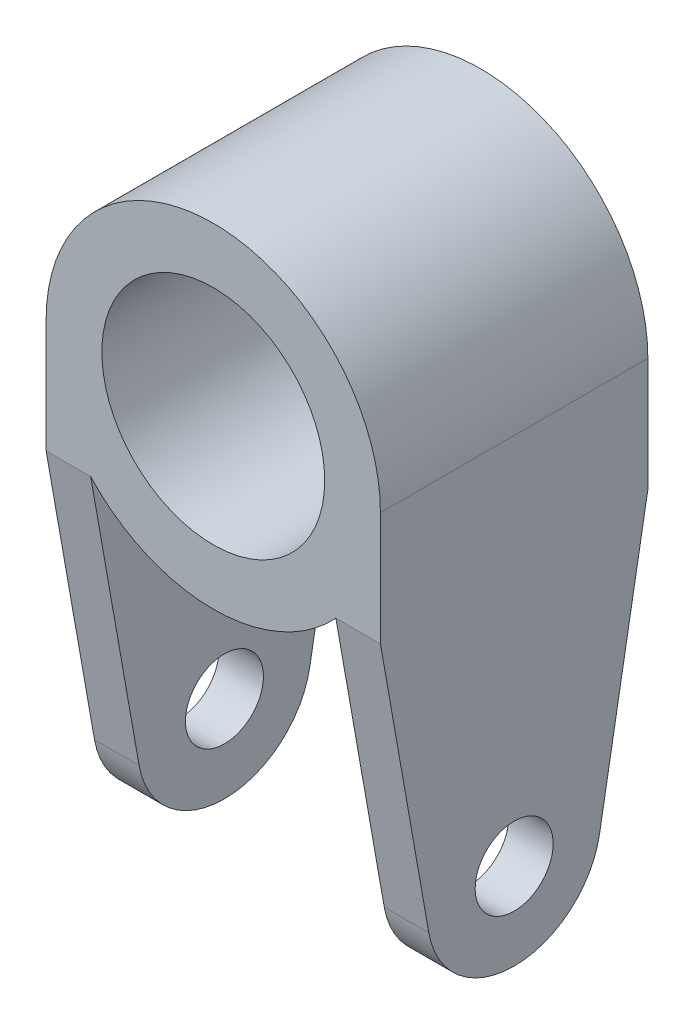
ISO-10303-21;
HEADER;
FILE_DESCRIPTION(('STEP AP214'),'2;1');
FILE_NAME('part.step','',(''),(''),'','','');
FILE_SCHEMA(('AUTOMOTIVE_DESIGN { 1 0 10303 214 1 1 1 1 }'));
ENDSEC;
DATA;
#1=APPLICATION_CONTEXT('core data for automotive mechanical design processes');
#2=APPLICATION_PROTOCOL_DEFINITION('international standard','automotive_design',2000,#1);
#3=PRODUCT_CONTEXT('',#1,'mechanical');
#4=PRODUCT('Part','Part','',(#3));
#5=PRODUCT_RELATED_PRODUCT_CATEGORY('part','',(#4));
#6=PRODUCT_DEFINITION_FORMATION('','',#4);
#7=PRODUCT_DEFINITION_CONTEXT('part definition',#1,'design');
#8=PRODUCT_DEFINITION('design','',#6,#7);
#9=PRODUCT_DEFINITION_SHAPE('','',#8);
#10=(LENGTH_UNIT() NAMED_UNIT(*) SI_UNIT(.MILLI.,.METRE.));
#11=(NAMED_UNIT(*) PLANE_ANGLE_UNIT() SI_UNIT($,.RADIAN.));
#12=(NAMED_UNIT(*) SI_UNIT($,.STERADIAN.) SOLID_ANGLE_UNIT());
#13=UNCERTAINTY_MEASURE_WITH_UNIT(LENGTH_MEASURE(1.E-05),#10,'distance_accuracy_value','');
#14=(GEOMETRIC_REPRESENTATION_CONTEXT(3) GLOBAL_UNCERTAINTY_ASSIGNED_CONTEXT((#13)) GLOBAL_UNIT_ASSIGNED_CONTEXT((#10,
#11,#12)) REPRESENTATION_CONTEXT('',''));
#15=CARTESIAN_POINT('',(0.,0.,0.));
#16=DIRECTION('',(0.,0.,1.));
#17=DIRECTION('',(1.,0.,0.));
#18=AXIS2_PLACEMENT_3D('',#15,#16,#17);
#19=CARTESIAN_POINT('',(0.,0.,24.));
#20=DIRECTION('',(0.,0.,1.));
#21=DIRECTION('',(1.,0.,0.));
#22=AXIS2_PLACEMENT_3D('',#19,#20,#21);
#23=PLANE('',#22);
#24=DIRECTION('',(1.,0.,0.));
#25=VECTOR('',#24,1.);
#26=CARTESIAN_POINT('',(-15.001,-10.1980390271856,24.));
#27=LINE('',#26,#25);
#28=CARTESIAN_POINT('',(11.,-10.1980390271856,24.));
#29=VERTEX_POINT('',#28);
#30=CARTESIAN_POINT('',(15.,-10.1980390271856,24.));
#31=VERTEX_POINT('',#30);
#32=EDGE_CURVE('E113',#29,#31,#27,.T.);
#33=ORIENTED_EDGE('',*,*,#32,.T.);
#34=DIRECTION('',(0.,1.,0.));
#35=VECTOR('',#34,1.);
#36=CARTESIAN_POINT('',(15.,-22.,24.));
#37=LINE('',#36,#35);
#38=CARTESIAN_POINT('',(15.,0.,24.));
#39=VERTEX_POINT('',#38);
#40=EDGE_CURVE('E145',#31,#39,#37,.T.);
#41=ORIENTED_EDGE('',*,*,#40,.T.);
#42=CARTESIAN_POINT('',(0.,0.,24.));
#43=DIRECTION('',(0.,0.,1.));
#44=DIRECTION('',(1.,0.,0.));
#45=AXIS2_PLACEMENT_3D('',#42,#43,#44);
#46=CIRCLE('',#45,15.);
#47=CARTESIAN_POINT('',(-15.,0.,24.));
#48=VERTEX_POINT('',#47);
#49=EDGE_CURVE('E159',#39,#48,#46,.T.);
#50=ORIENTED_EDGE('',*,*,#49,.T.);
#51=DIRECTION('',(0.,-1.,0.));
#52=VECTOR('',#51,1.);
#53=CARTESIAN_POINT('',(-15.,0.,24.));
#54=LINE('',#53,#52);
#55=CARTESIAN_POINT('',(-15.,-10.1980390271856,24.));
#56=VERTEX_POINT('',#55);
#57=EDGE_CURVE('E146',#48,#56,#54,.T.);
#58=ORIENTED_EDGE('',*,*,#57,.T.);
#59=DIRECTION('',(-1.,0.,0.));
#60=VECTOR('',#59,1.);
#61=CARTESIAN_POINT('',(15.001,-10.1980390271856,24.));
#62=LINE('',#61,#60);
#63=CARTESIAN_POINT('',(-11.,-10.1980390271856,24.));
#64=VERTEX_POINT('',#63);
#65=EDGE_CURVE('E141',#64,#56,#62,.T.);
#66=ORIENTED_EDGE('',*,*,#65,.F.);
#67=CARTESIAN_POINT('',(0.,0.,24.));
#68=DIRECTION('',(0.,0.,1.));
#69=DIRECTION('',(1.,0.,0.));
#70=AXIS2_PLACEMENT_3D('',#67,#68,#69);
#71=CIRCLE('',#70,15.);
#72=EDGE_CURVE('E138',#64,#29,#71,.T.);
#73=ORIENTED_EDGE('',*,*,#72,.T.);
#74=EDGE_LOOP('',(#33,#41,#50,#58,#66,#73));
#75=FACE_BOUND('',#74,.T.);
#76=CARTESIAN_POINT('',(0.,0.,24.));
#77=DIRECTION('',(0.,0.,1.));
#78=DIRECTION('',(1.,0.,0.));
#79=AXIS2_PLACEMENT_3D('',#76,#77,#78);
#80=CIRCLE('',#79,10.);
#81=CARTESIAN_POINT('',(10.,0.,24.));
#82=VERTEX_POINT('',#81);
#83=EDGE_CURVE('E167',#82,#82,#80,.T.);
#84=ORIENTED_EDGE('',*,*,#83,.F.);
#85=EDGE_LOOP('',(#84));
#86=FACE_BOUND('',#85,.T.);
#87=ADVANCED_FACE('F36',(#75,#86),#23,.T.);
#88=CARTESIAN_POINT('',(0.,0.,0.));
#89=DIRECTION('',(0.,0.,1.));
#90=DIRECTION('',(1.,0.,0.));
#91=AXIS2_PLACEMENT_3D('',#88,#89,#90);
#92=PLANE('',#91);
#93=DIRECTION('',(0.,1.,0.));
#94=VECTOR('',#93,1.);
#95=CARTESIAN_POINT('',(15.,0.,0.));
#96=LINE('',#95,#94);
#97=CARTESIAN_POINT('',(15.,-10.1980390271856,0.));
#98=VERTEX_POINT('',#97);
#99=CARTESIAN_POINT('',(15.,0.,0.));
#100=VERTEX_POINT('',#99);
#101=EDGE_CURVE('E157',#98,#100,#96,.T.);
#102=ORIENTED_EDGE('',*,*,#101,.F.);
#103=DIRECTION('',(1.,0.,0.));
#104=VECTOR('',#103,1.);
#105=CARTESIAN_POINT('',(-15.001,-10.1980390271856,0.));
#106=LINE('',#105,#104);
#107=CARTESIAN_POINT('',(11.,-10.1980390271856,0.));
#108=VERTEX_POINT('',#107);
#109=EDGE_CURVE('E123',#108,#98,#106,.T.);
#110=ORIENTED_EDGE('',*,*,#109,.F.);
#111=CARTESIAN_POINT('',(0.,0.,0.));
#112=DIRECTION('',(0.,0.,1.));
#113=DIRECTION('',(1.,0.,0.));
#114=AXIS2_PLACEMENT_3D('',#111,#112,#113);
#115=CIRCLE('',#114,15.);
#116=CARTESIAN_POINT('',(-11.,-10.1980390271856,0.));
#117=VERTEX_POINT('',#116);
#118=EDGE_CURVE('E151',#117,#108,#115,.T.);
#119=ORIENTED_EDGE('',*,*,#118,.F.);
#120=DIRECTION('',(-1.,0.,0.));
#121=VECTOR('',#120,1.);
#122=CARTESIAN_POINT('',(15.001,-10.1980390271856,0.));
#123=LINE('',#122,#121);
#124=CARTESIAN_POINT('',(-15.,-10.1980390271856,0.));
#125=VERTEX_POINT('',#124);
#126=EDGE_CURVE('E183',#117,#125,#123,.T.);
#127=ORIENTED_EDGE('',*,*,#126,.T.);
#128=DIRECTION('',(0.,-1.,0.));
#129=VECTOR('',#128,1.);
#130=CARTESIAN_POINT('',(-15.,-15.,0.));
#131=LINE('',#130,#129);
#132=CARTESIAN_POINT('',(-15.,0.,0.));
#133=VERTEX_POINT('',#132);
#134=EDGE_CURVE('E161',#133,#125,#131,.T.);
#135=ORIENTED_EDGE('',*,*,#134,.F.);
#136=CARTESIAN_POINT('',(0.,0.,0.));
#137=DIRECTION('',(0.,0.,1.));
#138=DIRECTION('',(1.,0.,0.));
#139=AXIS2_PLACEMENT_3D('',#136,#137,#138);
#140=CIRCLE('',#139,15.);
#141=EDGE_CURVE('E164',#100,#133,#140,.T.);
#142=ORIENTED_EDGE('',*,*,#141,.F.);
#143=EDGE_LOOP('',(#102,#110,#119,#127,#135,#142));
#144=FACE_BOUND('',#143,.T.);
#145=CARTESIAN_POINT('',(0.,0.,0.));
#146=DIRECTION('',(0.,0.,1.));
#147=DIRECTION('',(1.,0.,0.));
#148=AXIS2_PLACEMENT_3D('',#145,#146,#147);
#149=CIRCLE('',#148,10.);
#150=CARTESIAN_POINT('',(10.,0.,0.));
#151=VERTEX_POINT('',#150);
#152=EDGE_CURVE('E172',#151,#151,#149,.T.);
#153=ORIENTED_EDGE('',*,*,#152,.T.);
#154=EDGE_LOOP('',(#153));
#155=FACE_BOUND('',#154,.T.);
#156=ADVANCED_FACE('F251',(#144,#155),#92,.F.);
#157=CARTESIAN_POINT('',(0.,0.,24.));
#158=DIRECTION('',(0.,0.,-1.));
#159=DIRECTION('',(-1.,0.,0.));
#160=AXIS2_PLACEMENT_3D('',#157,#158,#159);
#161=CYLINDRICAL_SURFACE('',#160,15.);
#162=ORIENTED_EDGE('',*,*,#141,.T.);
#163=DIRECTION('',(0.,0.,-1.));
#164=VECTOR('',#163,1.);
#165=CARTESIAN_POINT('',(-15.,0.,24.));
#166=LINE('',#165,#164);
#167=EDGE_CURVE('E11',#48,#133,#166,.T.);
#168=ORIENTED_EDGE('',*,*,#167,.F.);
#169=ORIENTED_EDGE('',*,*,#49,.F.);
#170=DIRECTION('',(0.,0.,-1.));
#171=VECTOR('',#170,1.);
#172=CARTESIAN_POINT('',(15.,0.,24.));
#173=LINE('',#172,#171);
#174=EDGE_CURVE('E152',#39,#100,#173,.T.);
#175=ORIENTED_EDGE('',*,*,#174,.T.);
#176=EDGE_LOOP('',(#162,#168,#169,#175));
#177=FACE_BOUND('',#176,.T.);
#178=ADVANCED_FACE('F38',(#177),#161,.T.);
#179=CARTESIAN_POINT('',(-15.,-15.,24.));
#180=DIRECTION('',(1.,0.,0.));
#181=DIRECTION('',(0.,1.,0.));
#182=AXIS2_PLACEMENT_3D('',#179,#180,#181);
#183=PLANE('',#182);
#184=CARTESIAN_POINT('',(-15.,-33.4677805558276,12.));
#185=DIRECTION('',(-1.,0.,0.));
#186=DIRECTION('',(0.,-1.,0.));
#187=AXIS2_PLACEMENT_3D('',#184,#185,#186);
#188=CIRCLE('',#187,3.50000000000001);
#189=CARTESIAN_POINT('',(-15.,-36.9677805558276,12.));
#190=VERTEX_POINT('',#189);
#191=EDGE_CURVE('E200',#190,#190,#188,.T.);
#192=ORIENTED_EDGE('',*,*,#191,.F.);
#193=EDGE_LOOP('',(#192));
#194=FACE_BOUND('',#193,.T.);
#195=ORIENTED_EDGE('',*,*,#134,.T.);
#196=DIRECTION('',(0.,0.984807753012207,-0.173648177666935));
#197=VECTOR('',#196,1.);
#198=CARTESIAN_POINT('',(-15.,-10.1980390271856,0.));
#199=LINE('',#198,#197);
#200=CARTESIAN_POINT('',(-15.,-34.8182328524907,4.34120444167337));
#201=VERTEX_POINT('',#200);
#202=EDGE_CURVE('E192',#201,#125,#199,.T.);
#203=ORIENTED_EDGE('',*,*,#202,.F.);
#204=CARTESIAN_POINT('',(-15.,-33.4677805558276,12.));
#205=DIRECTION('',(1.,0.,0.));
#206=DIRECTION('',(0.,-1.,0.));
#207=AXIS2_PLACEMENT_3D('',#204,#205,#206);
#208=CIRCLE('',#207,7.77694482491721);
#209=CARTESIAN_POINT('',(-15.,-34.8182328524908,19.6587955583266));
#210=VERTEX_POINT('',#209);
#211=EDGE_CURVE('E195',#210,#201,#208,.T.);
#212=ORIENTED_EDGE('',*,*,#211,.F.);
#213=DIRECTION('',(0.,-0.984807753012207,-0.173648177666935));
#214=VECTOR('',#213,1.);
#215=CARTESIAN_POINT('',(-15.,-34.8182328524908,19.6587955583266));
#216=LINE('',#215,#214);
#217=EDGE_CURVE('E180',#56,#210,#216,.T.);
#218=ORIENTED_EDGE('',*,*,#217,.F.);
#219=ORIENTED_EDGE('',*,*,#57,.F.);
#220=ORIENTED_EDGE('',*,*,#167,.T.);
#221=EDGE_LOOP('',(#195,#203,#212,#218,#219,#220));
#222=FACE_BOUND('',#221,.T.);
#223=ADVANCED_FACE('F239',(#194,#222),#183,.F.);
#224=CARTESIAN_POINT('',(-11.,-42.,24.));
#225=DIRECTION('',(-1.,0.,0.));
#226=DIRECTION('',(0.,-1.,0.));
#227=AXIS2_PLACEMENT_3D('',#224,#225,#226);
#228=PLANE('',#227);
#229=CARTESIAN_POINT('',(-11.,-33.4677805558276,12.));
#230=DIRECTION('',(-1.,0.,0.));
#231=DIRECTION('',(0.,-1.,0.));
#232=AXIS2_PLACEMENT_3D('',#229,#230,#231);
#233=CIRCLE('',#232,3.50000000000001);
#234=CARTESIAN_POINT('',(-11.,-36.9677805558276,12.));
#235=VERTEX_POINT('',#234);
#236=EDGE_CURVE('E187',#235,#235,#233,.F.);
#237=ORIENTED_EDGE('',*,*,#236,.F.);
#238=EDGE_LOOP('',(#237));
#239=FACE_BOUND('',#238,.T.);
#240=CARTESIAN_POINT('',(-11.,-33.4677805558276,12.));
#241=DIRECTION('',(-1.,0.,0.));
#242=DIRECTION('',(0.,-1.,0.));
#243=AXIS2_PLACEMENT_3D('',#240,#241,#242);
#244=CIRCLE('',#243,7.77694482491721);
#245=CARTESIAN_POINT('',(-11.,-34.8182328524907,4.34120444167337));
#246=VERTEX_POINT('',#245);
#247=CARTESIAN_POINT('',(-11.,-34.8182328524908,19.6587955583266));
#248=VERTEX_POINT('',#247);
#249=EDGE_CURVE('E59',#246,#248,#244,.T.);
#250=ORIENTED_EDGE('',*,*,#249,.F.);
#251=DIRECTION('',(0.,-0.984807753012207,0.173648177666935));
#252=VECTOR('',#251,1.);
#253=CARTESIAN_POINT('',(-11.,-10.1980390271856,0.));
#254=LINE('',#253,#252);
#255=EDGE_CURVE('E189',#117,#246,#254,.T.);
#256=ORIENTED_EDGE('',*,*,#255,.F.);
#257=DIRECTION('',(0.,0.,-1.));
#258=VECTOR('',#257,1.);
#259=CARTESIAN_POINT('',(-11.,-10.1980390271856,24.));
#260=LINE('',#259,#258);
#261=EDGE_CURVE('E44',#64,#117,#260,.T.);
#262=ORIENTED_EDGE('',*,*,#261,.F.);
#263=DIRECTION('',(0.,0.984807753012207,0.173648177666935));
#264=VECTOR('',#263,1.);
#265=CARTESIAN_POINT('',(-11.,-34.8182328524908,19.6587955583266));
#266=LINE('',#265,#264);
#267=EDGE_CURVE('E175',#248,#64,#266,.T.);
#268=ORIENTED_EDGE('',*,*,#267,.F.);
#269=EDGE_LOOP('',(#250,#256,#262,#268));
#270=FACE_BOUND('',#269,.T.);
#271=ADVANCED_FACE('F247',(#239,#270),#228,.F.);
#272=CARTESIAN_POINT('',(0.,0.,24.));
#273=DIRECTION('',(0.,0.,-1.));
#274=DIRECTION('',(-1.,0.,0.));
#275=AXIS2_PLACEMENT_3D('',#272,#273,#274);
#276=CYLINDRICAL_SURFACE('',#275,15.);
#277=ORIENTED_EDGE('',*,*,#118,.T.);
#278=DIRECTION('',(0.,0.,-1.));
#279=VECTOR('',#278,1.);
#280=CARTESIAN_POINT('',(11.,-10.1980390271856,24.));
#281=LINE('',#280,#279);
#282=EDGE_CURVE('E131',#29,#108,#281,.T.);
#283=ORIENTED_EDGE('',*,*,#282,.F.);
#284=ORIENTED_EDGE('',*,*,#72,.F.);
#285=ORIENTED_EDGE('',*,*,#261,.T.);
#286=EDGE_LOOP('',(#277,#283,#284,#285));
#287=FACE_BOUND('',#286,.T.);
#288=ADVANCED_FACE('F149',(#287),#276,.T.);
#289=CARTESIAN_POINT('',(11.,-42.,24.));
#290=DIRECTION('',(1.,0.,0.));
#291=DIRECTION('',(0.,0.,-1.));
#292=AXIS2_PLACEMENT_3D('',#289,#290,#291);
#293=PLANE('',#292);
#294=CARTESIAN_POINT('',(11.,-33.4677805558276,12.));
#295=DIRECTION('',(1.,0.,0.));
#296=DIRECTION('',(0.,0.,-1.));
#297=AXIS2_PLACEMENT_3D('',#294,#295,#296);
#298=CIRCLE('',#297,3.50000000000001);
#299=CARTESIAN_POINT('',(11.,-33.4677805558276,8.49999999999999));
#300=VERTEX_POINT('',#299);
#301=EDGE_CURVE('E134',#300,#300,#298,.F.);
#302=ORIENTED_EDGE('',*,*,#301,.F.);
#303=EDGE_LOOP('',(#302));
#304=FACE_BOUND('',#303,.T.);
#305=ORIENTED_EDGE('',*,*,#282,.T.);
#306=DIRECTION('',(0.,0.984807753012207,-0.173648177666935));
#307=VECTOR('',#306,1.);
#308=CARTESIAN_POINT('',(11.,-10.1980390271856,0.));
#309=LINE('',#308,#307);
#310=CARTESIAN_POINT('',(11.,-34.8182328524908,4.34120444167337));
#311=VERTEX_POINT('',#310);
#312=EDGE_CURVE('E206',#311,#108,#309,.T.);
#313=ORIENTED_EDGE('',*,*,#312,.F.);
#314=CARTESIAN_POINT('',(11.,-33.4677805558276,12.));
#315=DIRECTION('',(1.,0.,0.));
#316=DIRECTION('',(0.,0.,-1.));
#317=AXIS2_PLACEMENT_3D('',#314,#315,#316);
#318=CIRCLE('',#317,7.77694482491721);
#319=CARTESIAN_POINT('',(11.,-34.8182328524908,19.6587955583266));
#320=VERTEX_POINT('',#319);
#321=EDGE_CURVE('E133',#320,#311,#318,.T.);
#322=ORIENTED_EDGE('',*,*,#321,.F.);
#323=DIRECTION('',(0.,-0.984807753012207,-0.173648177666935));
#324=VECTOR('',#323,1.);
#325=CARTESIAN_POINT('',(11.,-34.8182328524908,19.6587955583266));
#326=LINE('',#325,#324);
#327=EDGE_CURVE('E116',#29,#320,#326,.T.);
#328=ORIENTED_EDGE('',*,*,#327,.F.);
#329=EDGE_LOOP('',(#305,#313,#322,#328));
#330=FACE_BOUND('',#329,.T.);
#331=ADVANCED_FACE('F128',(#304,#330),#293,.F.);
#332=CARTESIAN_POINT('',(15.,0.,24.));
#333=DIRECTION('',(-1.,0.,0.));
#334=DIRECTION('',(0.,-1.,0.));
#335=AXIS2_PLACEMENT_3D('',#332,#333,#334);
#336=PLANE('',#335);
#337=CARTESIAN_POINT('',(15.,-33.4677805558276,12.));
#338=DIRECTION('',(1.,0.,0.));
#339=DIRECTION('',(0.,1.,0.));
#340=AXIS2_PLACEMENT_3D('',#337,#338,#339);
#341=CIRCLE('',#340,3.50000000000001);
#342=CARTESIAN_POINT('',(15.,-29.9677805558276,12.));
#343=VERTEX_POINT('',#342);
#344=EDGE_CURVE('E219',#343,#343,#341,.T.);
#345=ORIENTED_EDGE('',*,*,#344,.F.);
#346=EDGE_LOOP('',(#345));
#347=FACE_BOUND('',#346,.T.);
#348=CARTESIAN_POINT('',(15.,-33.4677805558276,12.));
#349=DIRECTION('',(-1.,0.,0.));
#350=DIRECTION('',(0.,1.,0.));
#351=AXIS2_PLACEMENT_3D('',#348,#349,#350);
#352=CIRCLE('',#351,7.77694482491721);
#353=CARTESIAN_POINT('',(15.,-34.8182328524908,4.34120444167337));
#354=VERTEX_POINT('',#353);
#355=CARTESIAN_POINT('',(15.,-34.8182328524908,19.6587955583266));
#356=VERTEX_POINT('',#355);
#357=EDGE_CURVE('E51',#354,#356,#352,.T.);
#358=ORIENTED_EDGE('',*,*,#357,.F.);
#359=DIRECTION('',(0.,-0.984807753012207,0.173648177666935));
#360=VECTOR('',#359,1.);
#361=CARTESIAN_POINT('',(15.,-10.1980390271856,0.));
#362=LINE('',#361,#360);
#363=EDGE_CURVE('E208',#98,#354,#362,.T.);
#364=ORIENTED_EDGE('',*,*,#363,.F.);
#365=ORIENTED_EDGE('',*,*,#101,.T.);
#366=ORIENTED_EDGE('',*,*,#174,.F.);
#367=ORIENTED_EDGE('',*,*,#40,.F.);
#368=DIRECTION('',(0.,0.984807753012207,0.173648177666935));
#369=VECTOR('',#368,1.);
#370=CARTESIAN_POINT('',(15.,-34.8182328524908,19.6587955583266));
#371=LINE('',#370,#369);
#372=EDGE_CURVE('E119',#356,#31,#371,.T.);
#373=ORIENTED_EDGE('',*,*,#372,.F.);
#374=EDGE_LOOP('',(#358,#364,#365,#366,#367,#373));
#375=FACE_BOUND('',#374,.T.);
#376=ADVANCED_FACE('F226',(#347,#375),#336,.F.);
#377=CARTESIAN_POINT('',(0.,0.,24.));
#378=DIRECTION('',(0.,0.,-1.));
#379=DIRECTION('',(-1.,0.,0.));
#380=AXIS2_PLACEMENT_3D('',#377,#378,#379);
#381=CYLINDRICAL_SURFACE('',#380,10.);
#382=ORIENTED_EDGE('',*,*,#83,.T.);
#383=EDGE_LOOP('',(#382));
#384=FACE_BOUND('',#383,.T.);
#385=ORIENTED_EDGE('',*,*,#152,.F.);
#386=EDGE_LOOP('',(#385));
#387=FACE_BOUND('',#386,.T.);
#388=ADVANCED_FACE('F229',(#384,#387),#381,.F.);
#389=CARTESIAN_POINT('',(15.001,-10.1980390271856,0.));
#390=DIRECTION('',(0.,0.173648177666935,0.984807753012207));
#391=DIRECTION('',(0.,-0.984807753012207,0.173648177666935));
#392=AXIS2_PLACEMENT_3D('',#389,#390,#391);
#393=PLANE('',#392);
#394=ORIENTED_EDGE('',*,*,#255,.T.);
#395=DIRECTION('',(-1.,0.,0.));
#396=VECTOR('',#395,1.);
#397=CARTESIAN_POINT('',(15.001,-34.8182328524907,4.34120444167337));
#398=LINE('',#397,#396);
#399=EDGE_CURVE('E181',#246,#201,#398,.T.);
#400=ORIENTED_EDGE('',*,*,#399,.T.);
#401=ORIENTED_EDGE('',*,*,#202,.T.);
#402=ORIENTED_EDGE('',*,*,#126,.F.);
#403=EDGE_LOOP('',(#394,#400,#401,#402));
#404=FACE_BOUND('',#403,.T.);
#405=ADVANCED_FACE('F300',(#404),#393,.F.);
#406=CARTESIAN_POINT('',(15.001,-33.4677805558276,12.));
#407=DIRECTION('',(-1.,0.,0.));
#408=DIRECTION('',(0.,-1.,0.));
#409=AXIS2_PLACEMENT_3D('',#406,#407,#408);
#410=CYLINDRICAL_SURFACE('',#409,7.77694482491721);
#411=ORIENTED_EDGE('',*,*,#249,.T.);
#412=DIRECTION('',(-1.,0.,0.));
#413=VECTOR('',#412,1.);
#414=CARTESIAN_POINT('',(15.001,-34.8182328524907,19.6587955583266));
#415=LINE('',#414,#413);
#416=EDGE_CURVE('E178',#248,#210,#415,.T.);
#417=ORIENTED_EDGE('',*,*,#416,.T.);
#418=ORIENTED_EDGE('',*,*,#211,.T.);
#419=ORIENTED_EDGE('',*,*,#399,.F.);
#420=EDGE_LOOP('',(#411,#417,#418,#419));
#421=FACE_BOUND('',#420,.T.);
#422=ADVANCED_FACE('F296',(#421),#410,.T.);
#423=CARTESIAN_POINT('',(15.001,-34.8182328524907,19.6587955583266));
#424=DIRECTION('',(0.,0.173648177666935,-0.984807753012207));
#425=DIRECTION('',(0.,0.984807753012207,0.173648177666935));
#426=AXIS2_PLACEMENT_3D('',#423,#424,#425);
#427=PLANE('',#426);
#428=ORIENTED_EDGE('',*,*,#267,.T.);
#429=ORIENTED_EDGE('',*,*,#65,.T.);
#430=ORIENTED_EDGE('',*,*,#217,.T.);
#431=ORIENTED_EDGE('',*,*,#416,.F.);
#432=EDGE_LOOP('',(#428,#429,#430,#431));
#433=FACE_BOUND('',#432,.T.);
#434=ADVANCED_FACE('F244',(#433),#427,.F.);
#435=CARTESIAN_POINT('',(15.001,-33.4677805558276,12.));
#436=DIRECTION('',(-1.,0.,0.));
#437=DIRECTION('',(0.,-1.,0.));
#438=AXIS2_PLACEMENT_3D('',#435,#436,#437);
#439=CYLINDRICAL_SURFACE('',#438,3.50000000000001);
#440=ORIENTED_EDGE('',*,*,#191,.T.);
#441=EDGE_LOOP('',(#440));
#442=FACE_BOUND('',#441,.T.);
#443=ORIENTED_EDGE('',*,*,#236,.T.);
#444=EDGE_LOOP('',(#443));
#445=FACE_BOUND('',#444,.T.);
#446=ADVANCED_FACE('F263',(#442,#445),#439,.F.);
#447=CARTESIAN_POINT('',(-15.001,-10.1980390271856,0.));
#448=DIRECTION('',(0.,0.173648177666935,0.984807753012207));
#449=DIRECTION('',(0.,-0.984807753012207,0.173648177666935));
#450=AXIS2_PLACEMENT_3D('',#447,#448,#449);
#451=PLANE('',#450);
#452=ORIENTED_EDGE('',*,*,#312,.T.);
#453=ORIENTED_EDGE('',*,*,#109,.T.);
#454=ORIENTED_EDGE('',*,*,#363,.T.);
#455=DIRECTION('',(1.,0.,0.));
#456=VECTOR('',#455,1.);
#457=CARTESIAN_POINT('',(-15.001,-34.8182328524908,4.34120444167337));
#458=LINE('',#457,#456);
#459=EDGE_CURVE('E212',#311,#354,#458,.T.);
#460=ORIENTED_EDGE('',*,*,#459,.F.);
#461=EDGE_LOOP('',(#452,#453,#454,#460));
#462=FACE_BOUND('',#461,.T.);
#463=ADVANCED_FACE('F254',(#462),#451,.F.);
#464=CARTESIAN_POINT('',(-15.001,-33.4677805558276,12.));
#465=DIRECTION('',(1.,0.,0.));
#466=DIRECTION('',(0.,1.,0.));
#467=AXIS2_PLACEMENT_3D('',#464,#465,#466);
#468=CYLINDRICAL_SURFACE('',#467,7.77694482491721);
#469=ORIENTED_EDGE('',*,*,#321,.T.);
#470=ORIENTED_EDGE('',*,*,#459,.T.);
#471=ORIENTED_EDGE('',*,*,#357,.T.);
#472=DIRECTION('',(1.,0.,0.));
#473=VECTOR('',#472,1.);
#474=CARTESIAN_POINT('',(-15.001,-34.8182328524908,19.6587955583266));
#475=LINE('',#474,#473);
#476=EDGE_CURVE('E124',#320,#356,#475,.T.);
#477=ORIENTED_EDGE('',*,*,#476,.F.);
#478=EDGE_LOOP('',(#469,#470,#471,#477));
#479=FACE_BOUND('',#478,.T.);
#480=ADVANCED_FACE('F255',(#479),#468,.T.);
#481=CARTESIAN_POINT('',(-15.001,-34.8182328524908,19.6587955583266));
#482=DIRECTION('',(0.,0.173648177666935,-0.984807753012207));
#483=DIRECTION('',(0.,0.984807753012207,0.173648177666935));
#484=AXIS2_PLACEMENT_3D('',#481,#482,#483);
#485=PLANE('',#484);
#486=ORIENTED_EDGE('',*,*,#327,.T.);
#487=ORIENTED_EDGE('',*,*,#476,.T.);
#488=ORIENTED_EDGE('',*,*,#372,.T.);
#489=ORIENTED_EDGE('',*,*,#32,.F.);
#490=EDGE_LOOP('',(#486,#487,#488,#489));
#491=FACE_BOUND('',#490,.T.);
#492=ADVANCED_FACE('F115',(#491),#485,.F.);
#493=CARTESIAN_POINT('',(-15.001,-33.4677805558276,12.));
#494=DIRECTION('',(1.,0.,0.));
#495=DIRECTION('',(0.,1.,0.));
#496=AXIS2_PLACEMENT_3D('',#493,#494,#495);
#497=CYLINDRICAL_SURFACE('',#496,3.50000000000001);
#498=ORIENTED_EDGE('',*,*,#344,.T.);
#499=EDGE_LOOP('',(#498));
#500=FACE_BOUND('',#499,.T.);
#501=ORIENTED_EDGE('',*,*,#301,.T.);
#502=EDGE_LOOP('',(#501));
#503=FACE_BOUND('',#502,.T.);
#504=ADVANCED_FACE('F223',(#500,#503),#497,.F.);
#505=CLOSED_SHELL('',(#87,#156,#178,#223,#271,#288,#331,#376,#388,#405,#422,#434,#446,#463,#480,
#492,#504));
#506=MANIFOLD_SOLID_BREP('B2',#505);
#507=ADVANCED_BREP_SHAPE_REPRESENTATION('',(#18,#506),#14);
#508=SHAPE_DEFINITION_REPRESENTATION(#9,#507);
ENDSEC;
END-ISO-10303-21;
